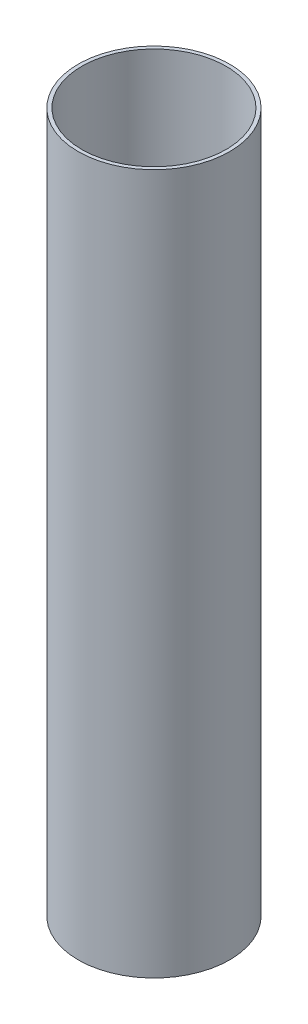
ISO-10303-21;
HEADER;
FILE_DESCRIPTION(('STEP AP214'),'2;1');
FILE_NAME('part.step','',(''),(''),'','','');
FILE_SCHEMA(('AUTOMOTIVE_DESIGN { 1 0 10303 214 1 1 1 1 }'));
ENDSEC;
DATA;
#1=APPLICATION_CONTEXT('core data for automotive mechanical design processes');
#2=APPLICATION_PROTOCOL_DEFINITION('international standard','automotive_design',2000,#1);
#3=PRODUCT_CONTEXT('',#1,'mechanical');
#4=PRODUCT('Part','Part','',(#3));
#5=PRODUCT_RELATED_PRODUCT_CATEGORY('part','',(#4));
#6=PRODUCT_DEFINITION_FORMATION('','',#4);
#7=PRODUCT_DEFINITION_CONTEXT('part definition',#1,'design');
#8=PRODUCT_DEFINITION('design','',#6,#7);
#9=PRODUCT_DEFINITION_SHAPE('','',#8);
#10=(LENGTH_UNIT() NAMED_UNIT(*) SI_UNIT(.MILLI.,.METRE.));
#11=(NAMED_UNIT(*) PLANE_ANGLE_UNIT() SI_UNIT($,.RADIAN.));
#12=(NAMED_UNIT(*) SI_UNIT($,.STERADIAN.) SOLID_ANGLE_UNIT());
#13=UNCERTAINTY_MEASURE_WITH_UNIT(LENGTH_MEASURE(1.E-05),#10,'distance_accuracy_value','');
#14=(GEOMETRIC_REPRESENTATION_CONTEXT(3) GLOBAL_UNCERTAINTY_ASSIGNED_CONTEXT((#13)) GLOBAL_UNIT_ASSIGNED_CONTEXT((#10,
#11,#12)) REPRESENTATION_CONTEXT('',''));
#15=CARTESIAN_POINT('',(0.,0.,0.));
#16=DIRECTION('',(0.,0.,1.));
#17=DIRECTION('',(1.,0.,0.));
#18=AXIS2_PLACEMENT_3D('',#15,#16,#17);
#19=CARTESIAN_POINT('',(0.,194.,0.));
#20=DIRECTION('',(0.,1.,0.));
#21=DIRECTION('',(0.,0.,1.));
#22=AXIS2_PLACEMENT_3D('',#19,#20,#21);
#23=PLANE('',#22);
#24=CARTESIAN_POINT('',(0.,194.,0.));
#25=DIRECTION('',(0.,1.,0.));
#26=DIRECTION('',(0.,0.,1.));
#27=AXIS2_PLACEMENT_3D('',#24,#25,#26);
#28=CIRCLE('',#27,21.);
#29=CARTESIAN_POINT('',(0.,194.,21.));
#30=VERTEX_POINT('',#29);
#31=EDGE_CURVE('E10',#30,#30,#28,.T.);
#32=ORIENTED_EDGE('',*,*,#31,.T.);
#33=EDGE_LOOP('',(#32));
#34=FACE_BOUND('',#33,.T.);
#35=CARTESIAN_POINT('',(0.,194.,0.));
#36=DIRECTION('',(0.,1.,0.));
#37=DIRECTION('',(0.,0.,1.));
#38=AXIS2_PLACEMENT_3D('',#35,#36,#37);
#39=CIRCLE('',#38,20.);
#40=CARTESIAN_POINT('',(0.,194.,20.));
#41=VERTEX_POINT('',#40);
#42=EDGE_CURVE('E52',#41,#41,#39,.T.);
#43=ORIENTED_EDGE('',*,*,#42,.F.);
#44=EDGE_LOOP('',(#43));
#45=FACE_BOUND('',#44,.T.);
#46=ADVANCED_FACE('F39',(#34,#45),#23,.T.);
#47=CARTESIAN_POINT('',(0.,0.,0.));
#48=DIRECTION('',(0.,1.,0.));
#49=DIRECTION('',(0.,0.,1.));
#50=AXIS2_PLACEMENT_3D('',#47,#48,#49);
#51=PLANE('',#50);
#52=CARTESIAN_POINT('',(0.,0.,0.));
#53=DIRECTION('',(0.,1.,0.));
#54=DIRECTION('',(0.,0.,1.));
#55=AXIS2_PLACEMENT_3D('',#52,#53,#54);
#56=CIRCLE('',#55,21.);
#57=CARTESIAN_POINT('',(0.,0.,21.));
#58=VERTEX_POINT('',#57);
#59=EDGE_CURVE('E43',#58,#58,#56,.T.);
#60=ORIENTED_EDGE('',*,*,#59,.F.);
#61=EDGE_LOOP('',(#60));
#62=FACE_BOUND('',#61,.T.);
#63=CARTESIAN_POINT('',(0.,0.,0.));
#64=DIRECTION('',(0.,1.,0.));
#65=DIRECTION('',(0.,0.,1.));
#66=AXIS2_PLACEMENT_3D('',#63,#64,#65);
#67=CIRCLE('',#66,20.);
#68=CARTESIAN_POINT('',(0.,0.,20.));
#69=VERTEX_POINT('',#68);
#70=EDGE_CURVE('E54',#69,#69,#67,.T.);
#71=ORIENTED_EDGE('',*,*,#70,.T.);
#72=EDGE_LOOP('',(#71));
#73=FACE_BOUND('',#72,.T.);
#74=ADVANCED_FACE('F66',(#62,#73),#51,.F.);
#75=CARTESIAN_POINT('',(0.,194.,0.));
#76=DIRECTION('',(0.,-1.,0.));
#77=DIRECTION('',(0.,0.,-1.));
#78=AXIS2_PLACEMENT_3D('',#75,#76,#77);
#79=CYLINDRICAL_SURFACE('',#78,21.);
#80=ORIENTED_EDGE('',*,*,#31,.F.);
#81=EDGE_LOOP('',(#80));
#82=FACE_BOUND('',#81,.T.);
#83=ORIENTED_EDGE('',*,*,#59,.T.);
#84=EDGE_LOOP('',(#83));
#85=FACE_BOUND('',#84,.T.);
#86=ADVANCED_FACE('F41',(#82,#85),#79,.T.);
#87=CARTESIAN_POINT('',(0.,194.,0.));
#88=DIRECTION('',(0.,-1.,0.));
#89=DIRECTION('',(0.,0.,-1.));
#90=AXIS2_PLACEMENT_3D('',#87,#88,#89);
#91=CYLINDRICAL_SURFACE('',#90,20.);
#92=ORIENTED_EDGE('',*,*,#42,.T.);
#93=EDGE_LOOP('',(#92));
#94=FACE_BOUND('',#93,.T.);
#95=ORIENTED_EDGE('',*,*,#70,.F.);
#96=EDGE_LOOP('',(#95));
#97=FACE_BOUND('',#96,.T.);
#98=ADVANCED_FACE('F62',(#94,#97),#91,.F.);
#99=CLOSED_SHELL('',(#46,#74,#86,#98));
#100=MANIFOLD_SOLID_BREP('B2',#99);
#101=ADVANCED_BREP_SHAPE_REPRESENTATION('',(#18,#100),#14);
#102=SHAPE_DEFINITION_REPRESENTATION(#9,#101);
ENDSEC;
END-ISO-10303-21;
